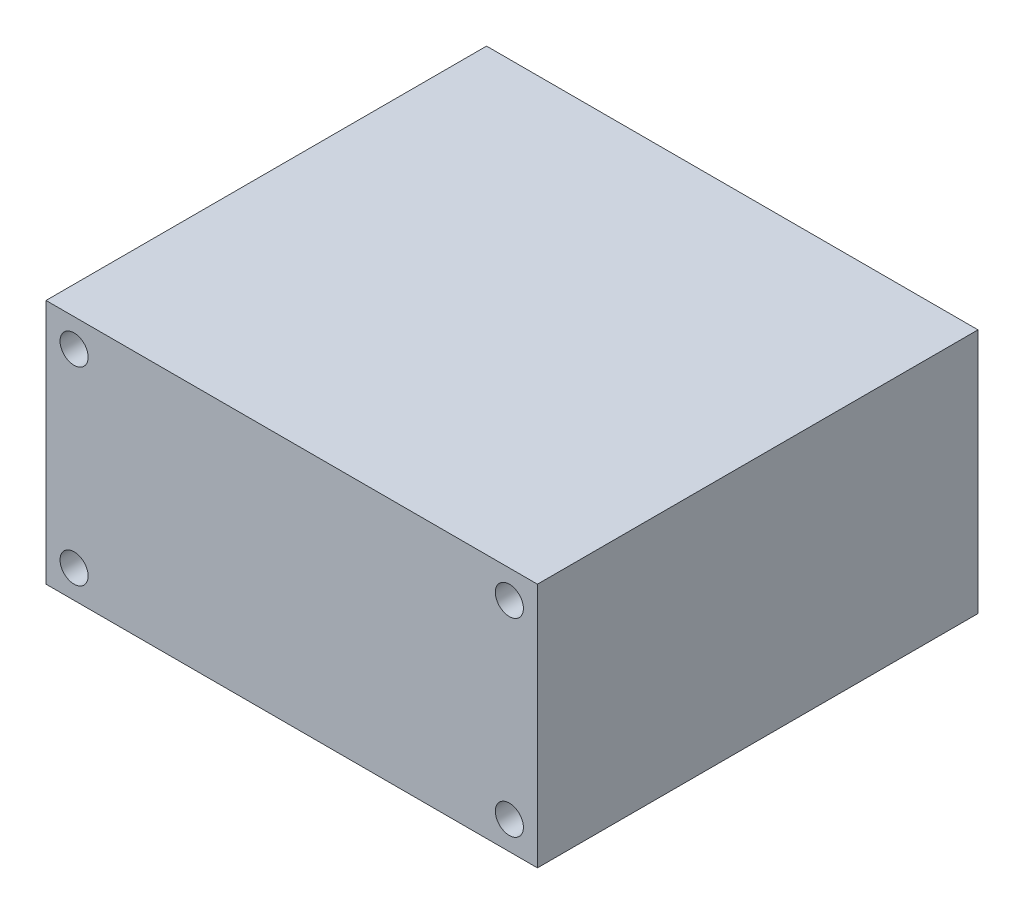
ISO-10303-21;
HEADER;
FILE_DESCRIPTION(('STEP AP214'),'2;1');
FILE_NAME('part.step','',(''),(''),'','','');
FILE_SCHEMA(('AUTOMOTIVE_DESIGN { 1 0 10303 214 1 1 1 1 }'));
ENDSEC;
DATA;
#1=APPLICATION_CONTEXT('core data for automotive mechanical design processes');
#2=APPLICATION_PROTOCOL_DEFINITION('international standard','automotive_design',2000,#1);
#3=PRODUCT_CONTEXT('',#1,'mechanical');
#4=PRODUCT('Part','Part','',(#3));
#5=PRODUCT_RELATED_PRODUCT_CATEGORY('part','',(#4));
#6=PRODUCT_DEFINITION_FORMATION('','',#4);
#7=PRODUCT_DEFINITION_CONTEXT('part definition',#1,'design');
#8=PRODUCT_DEFINITION('design','',#6,#7);
#9=PRODUCT_DEFINITION_SHAPE('','',#8);
#10=(LENGTH_UNIT() NAMED_UNIT(*) SI_UNIT(.MILLI.,.METRE.));
#11=(NAMED_UNIT(*) PLANE_ANGLE_UNIT() SI_UNIT($,.RADIAN.));
#12=(NAMED_UNIT(*) SI_UNIT($,.STERADIAN.) SOLID_ANGLE_UNIT());
#13=UNCERTAINTY_MEASURE_WITH_UNIT(LENGTH_MEASURE(1.E-05),#10,'distance_accuracy_value','');
#14=(GEOMETRIC_REPRESENTATION_CONTEXT(3) GLOBAL_UNCERTAINTY_ASSIGNED_CONTEXT((#13)) GLOBAL_UNIT_ASSIGNED_CONTEXT((#10,
#11,#12)) REPRESENTATION_CONTEXT('',''));
#15=CARTESIAN_POINT('',(0.,0.,0.));
#16=DIRECTION('',(0.,0.,1.));
#17=DIRECTION('',(1.,0.,0.));
#18=AXIS2_PLACEMENT_3D('',#15,#16,#17);
#19=CARTESIAN_POINT('',(0.,28.,50.2));
#20=DIRECTION('',(-1.,0.,0.));
#21=DIRECTION('',(0.,0.,1.));
#22=AXIS2_PLACEMENT_3D('',#19,#20,#21);
#23=PLANE('',#22);
#24=DIRECTION('',(0.,1.,0.));
#25=VECTOR('',#24,1.);
#26=CARTESIAN_POINT('',(0.,28.,0.));
#27=LINE('',#26,#25);
#28=CARTESIAN_POINT('',(0.,0.,0.));
#29=VERTEX_POINT('',#28);
#30=CARTESIAN_POINT('',(0.,28.,0.));
#31=VERTEX_POINT('',#30);
#32=EDGE_CURVE('E98',#29,#31,#27,.T.);
#33=ORIENTED_EDGE('',*,*,#32,.T.);
#34=DIRECTION('',(0.,0.,-1.));
#35=VECTOR('',#34,1.);
#36=CARTESIAN_POINT('',(0.,28.,50.2));
#37=LINE('',#36,#35);
#38=CARTESIAN_POINT('',(0.,28.,50.2));
#39=VERTEX_POINT('',#38);
#40=EDGE_CURVE('E11',#39,#31,#37,.T.);
#41=ORIENTED_EDGE('',*,*,#40,.F.);
#42=DIRECTION('',(0.,1.,0.));
#43=VECTOR('',#42,1.);
#44=CARTESIAN_POINT('',(0.,28.,50.2));
#45=LINE('',#44,#43);
#46=CARTESIAN_POINT('',(0.,0.,50.2));
#47=VERTEX_POINT('',#46);
#48=EDGE_CURVE('E86',#47,#39,#45,.T.);
#49=ORIENTED_EDGE('',*,*,#48,.F.);
#50=DIRECTION('',(0.,0.,-1.));
#51=VECTOR('',#50,1.);
#52=CARTESIAN_POINT('',(0.,0.,50.2));
#53=LINE('',#52,#51);
#54=EDGE_CURVE('E94',#47,#29,#53,.T.);
#55=ORIENTED_EDGE('',*,*,#54,.T.);
#56=EDGE_LOOP('',(#33,#41,#49,#55));
#57=FACE_BOUND('',#56,.T.);
#58=ADVANCED_FACE('F35',(#57),#23,.F.);
#59=CARTESIAN_POINT('',(-56.,28.,50.2));
#60=DIRECTION('',(0.,-1.,0.));
#61=DIRECTION('',(0.,0.,-1.));
#62=AXIS2_PLACEMENT_3D('',#59,#60,#61);
#63=PLANE('',#62);
#64=DIRECTION('',(-1.,0.,0.));
#65=VECTOR('',#64,1.);
#66=CARTESIAN_POINT('',(-56.,28.,0.));
#67=LINE('',#66,#65);
#68=CARTESIAN_POINT('',(-56.,28.,0.));
#69=VERTEX_POINT('',#68);
#70=EDGE_CURVE('E90',#31,#69,#67,.T.);
#71=ORIENTED_EDGE('',*,*,#70,.T.);
#72=DIRECTION('',(0.,0.,-1.));
#73=VECTOR('',#72,1.);
#74=CARTESIAN_POINT('',(-56.,28.,50.2));
#75=LINE('',#74,#73);
#76=CARTESIAN_POINT('',(-56.,28.,50.2));
#77=VERTEX_POINT('',#76);
#78=EDGE_CURVE('E43',#77,#69,#75,.T.);
#79=ORIENTED_EDGE('',*,*,#78,.F.);
#80=DIRECTION('',(-1.,0.,0.));
#81=VECTOR('',#80,1.);
#82=CARTESIAN_POINT('',(-56.,28.,50.2));
#83=LINE('',#82,#81);
#84=EDGE_CURVE('E81',#39,#77,#83,.T.);
#85=ORIENTED_EDGE('',*,*,#84,.F.);
#86=ORIENTED_EDGE('',*,*,#40,.T.);
#87=EDGE_LOOP('',(#71,#79,#85,#86));
#88=FACE_BOUND('',#87,.T.);
#89=ADVANCED_FACE('F89',(#88),#63,.F.);
#90=CARTESIAN_POINT('',(-56.,28.,50.2));
#91=DIRECTION('',(1.,0.,0.));
#92=DIRECTION('',(0.,1.,0.));
#93=AXIS2_PLACEMENT_3D('',#90,#91,#92);
#94=PLANE('',#93);
#95=DIRECTION('',(0.,-1.,0.));
#96=VECTOR('',#95,1.);
#97=CARTESIAN_POINT('',(-56.,28.,0.));
#98=LINE('',#97,#96);
#99=CARTESIAN_POINT('',(-56.,0.,0.));
#100=VERTEX_POINT('',#99);
#101=EDGE_CURVE('E68',#69,#100,#98,.T.);
#102=ORIENTED_EDGE('',*,*,#101,.T.);
#103=DIRECTION('',(0.,0.,-1.));
#104=VECTOR('',#103,1.);
#105=CARTESIAN_POINT('',(-56.,0.,50.2));
#106=LINE('',#105,#104);
#107=CARTESIAN_POINT('',(-56.,0.,50.2));
#108=VERTEX_POINT('',#107);
#109=EDGE_CURVE('E91',#108,#100,#106,.T.);
#110=ORIENTED_EDGE('',*,*,#109,.F.);
#111=DIRECTION('',(0.,-1.,0.));
#112=VECTOR('',#111,1.);
#113=CARTESIAN_POINT('',(-56.,28.,50.2));
#114=LINE('',#113,#112);
#115=EDGE_CURVE('E84',#77,#108,#114,.T.);
#116=ORIENTED_EDGE('',*,*,#115,.F.);
#117=ORIENTED_EDGE('',*,*,#78,.T.);
#118=EDGE_LOOP('',(#102,#110,#116,#117));
#119=FACE_BOUND('',#118,.T.);
#120=ADVANCED_FACE('F92',(#119),#94,.F.);
#121=CARTESIAN_POINT('',(-56.,0.,50.2));
#122=DIRECTION('',(0.,1.,0.));
#123=DIRECTION('',(0.,0.,1.));
#124=AXIS2_PLACEMENT_3D('',#121,#122,#123);
#125=PLANE('',#124);
#126=DIRECTION('',(1.,0.,0.));
#127=VECTOR('',#126,1.);
#128=CARTESIAN_POINT('',(-56.,0.,0.));
#129=LINE('',#128,#127);
#130=EDGE_CURVE('E74',#100,#29,#129,.T.);
#131=ORIENTED_EDGE('',*,*,#130,.T.);
#132=ORIENTED_EDGE('',*,*,#54,.F.);
#133=DIRECTION('',(1.,0.,0.));
#134=VECTOR('',#133,1.);
#135=CARTESIAN_POINT('',(-56.,0.,50.2));
#136=LINE('',#135,#134);
#137=EDGE_CURVE('E51',#108,#47,#136,.T.);
#138=ORIENTED_EDGE('',*,*,#137,.F.);
#139=ORIENTED_EDGE('',*,*,#109,.T.);
#140=EDGE_LOOP('',(#131,#132,#138,#139));
#141=FACE_BOUND('',#140,.T.);
#142=ADVANCED_FACE('F106',(#141),#125,.F.);
#143=CARTESIAN_POINT('',(0.,0.,50.2));
#144=DIRECTION('',(0.,0.,1.));
#145=DIRECTION('',(1.,0.,0.));
#146=AXIS2_PLACEMENT_3D('',#143,#144,#145);
#147=PLANE('',#146);
#148=CARTESIAN_POINT('',(-3.19999999999999,24.8,50.2));
#149=DIRECTION('',(0.,0.,1.));
#150=DIRECTION('',(1.,0.,0.));
#151=AXIS2_PLACEMENT_3D('',#148,#149,#150);
#152=CIRCLE('',#151,1.6);
#153=CARTESIAN_POINT('',(-1.59999999999999,24.8,50.2));
#154=VERTEX_POINT('',#153);
#155=EDGE_CURVE('E121',#154,#154,#152,.T.);
#156=ORIENTED_EDGE('',*,*,#155,.F.);
#157=EDGE_LOOP('',(#156));
#158=FACE_BOUND('',#157,.T.);
#159=CARTESIAN_POINT('',(-3.19999999999999,3.2,50.2));
#160=DIRECTION('',(0.,0.,1.));
#161=DIRECTION('',(1.,0.,0.));
#162=AXIS2_PLACEMENT_3D('',#159,#160,#161);
#163=CIRCLE('',#162,1.6);
#164=CARTESIAN_POINT('',(-1.59999999999999,3.2,50.2));
#165=VERTEX_POINT('',#164);
#166=EDGE_CURVE('E127',#165,#165,#163,.T.);
#167=ORIENTED_EDGE('',*,*,#166,.F.);
#168=EDGE_LOOP('',(#167));
#169=FACE_BOUND('',#168,.T.);
#170=CARTESIAN_POINT('',(-52.8,3.2,50.2));
#171=DIRECTION('',(0.,0.,1.));
#172=DIRECTION('',(1.,0.,0.));
#173=AXIS2_PLACEMENT_3D('',#170,#171,#172);
#174=CIRCLE('',#173,1.6);
#175=CARTESIAN_POINT('',(-51.2,3.2,50.2));
#176=VERTEX_POINT('',#175);
#177=EDGE_CURVE('E115',#176,#176,#174,.T.);
#178=ORIENTED_EDGE('',*,*,#177,.F.);
#179=EDGE_LOOP('',(#178));
#180=FACE_BOUND('',#179,.T.);
#181=CARTESIAN_POINT('',(-52.8,24.8,50.2));
#182=DIRECTION('',(0.,0.,1.));
#183=DIRECTION('',(1.,0.,0.));
#184=AXIS2_PLACEMENT_3D('',#181,#182,#183);
#185=CIRCLE('',#184,1.6);
#186=CARTESIAN_POINT('',(-51.2,24.8,50.2));
#187=VERTEX_POINT('',#186);
#188=EDGE_CURVE('E112',#187,#187,#185,.T.);
#189=ORIENTED_EDGE('',*,*,#188,.F.);
#190=EDGE_LOOP('',(#189));
#191=FACE_BOUND('',#190,.T.);
#192=ORIENTED_EDGE('',*,*,#48,.T.);
#193=ORIENTED_EDGE('',*,*,#84,.T.);
#194=ORIENTED_EDGE('',*,*,#115,.T.);
#195=ORIENTED_EDGE('',*,*,#137,.T.);
#196=EDGE_LOOP('',(#192,#193,#194,#195));
#197=FACE_BOUND('',#196,.T.);
#198=ADVANCED_FACE('F82',(#158,#169,#180,#191,#197),#147,.T.);
#199=CARTESIAN_POINT('',(0.,0.,0.));
#200=DIRECTION('',(0.,0.,1.));
#201=DIRECTION('',(1.,0.,0.));
#202=AXIS2_PLACEMENT_3D('',#199,#200,#201);
#203=PLANE('',#202);
#204=CARTESIAN_POINT('',(-3.19999999999999,24.8,0.));
#205=DIRECTION('',(0.,0.,1.));
#206=DIRECTION('',(1.,0.,0.));
#207=AXIS2_PLACEMENT_3D('',#204,#205,#206);
#208=CIRCLE('',#207,1.6);
#209=CARTESIAN_POINT('',(-1.59999999999999,24.8,0.));
#210=VERTEX_POINT('',#209);
#211=EDGE_CURVE('E118',#210,#210,#208,.T.);
#212=ORIENTED_EDGE('',*,*,#211,.T.);
#213=EDGE_LOOP('',(#212));
#214=FACE_BOUND('',#213,.T.);
#215=CARTESIAN_POINT('',(-3.19999999999999,3.2,0.));
#216=DIRECTION('',(0.,0.,1.));
#217=DIRECTION('',(1.,0.,0.));
#218=AXIS2_PLACEMENT_3D('',#215,#216,#217);
#219=CIRCLE('',#218,1.6);
#220=CARTESIAN_POINT('',(-1.59999999999999,3.2,0.));
#221=VERTEX_POINT('',#220);
#222=EDGE_CURVE('E124',#221,#221,#219,.T.);
#223=ORIENTED_EDGE('',*,*,#222,.T.);
#224=EDGE_LOOP('',(#223));
#225=FACE_BOUND('',#224,.T.);
#226=CARTESIAN_POINT('',(-52.8,3.2,0.));
#227=DIRECTION('',(0.,0.,1.));
#228=DIRECTION('',(1.,0.,0.));
#229=AXIS2_PLACEMENT_3D('',#226,#227,#228);
#230=CIRCLE('',#229,1.6);
#231=CARTESIAN_POINT('',(-51.2,3.2,0.));
#232=VERTEX_POINT('',#231);
#233=EDGE_CURVE('E130',#232,#232,#230,.T.);
#234=ORIENTED_EDGE('',*,*,#233,.T.);
#235=EDGE_LOOP('',(#234));
#236=FACE_BOUND('',#235,.T.);
#237=CARTESIAN_POINT('',(-52.8,24.8,0.));
#238=DIRECTION('',(0.,0.,1.));
#239=DIRECTION('',(1.,0.,0.));
#240=AXIS2_PLACEMENT_3D('',#237,#238,#239);
#241=CIRCLE('',#240,1.6);
#242=CARTESIAN_POINT('',(-51.2,24.8,0.));
#243=VERTEX_POINT('',#242);
#244=EDGE_CURVE('E101',#243,#243,#241,.T.);
#245=ORIENTED_EDGE('',*,*,#244,.T.);
#246=EDGE_LOOP('',(#245));
#247=FACE_BOUND('',#246,.T.);
#248=ORIENTED_EDGE('',*,*,#32,.F.);
#249=ORIENTED_EDGE('',*,*,#130,.F.);
#250=ORIENTED_EDGE('',*,*,#101,.F.);
#251=ORIENTED_EDGE('',*,*,#70,.F.);
#252=EDGE_LOOP('',(#248,#249,#250,#251));
#253=FACE_BOUND('',#252,.T.);
#254=ADVANCED_FACE('F109',(#214,#225,#236,#247,#253),#203,.F.);
#255=CARTESIAN_POINT('',(-52.8,24.8,0.));
#256=DIRECTION('',(0.,0.,1.));
#257=DIRECTION('',(1.,0.,0.));
#258=AXIS2_PLACEMENT_3D('',#255,#256,#257);
#259=CYLINDRICAL_SURFACE('',#258,1.6);
#260=ORIENTED_EDGE('',*,*,#244,.F.);
#261=EDGE_LOOP('',(#260));
#262=FACE_BOUND('',#261,.T.);
#263=ORIENTED_EDGE('',*,*,#188,.T.);
#264=EDGE_LOOP('',(#263));
#265=FACE_BOUND('',#264,.T.);
#266=ADVANCED_FACE('F144',(#262,#265),#259,.F.);
#267=CARTESIAN_POINT('',(-52.8,3.2,0.));
#268=DIRECTION('',(0.,0.,1.));
#269=DIRECTION('',(1.,0.,0.));
#270=AXIS2_PLACEMENT_3D('',#267,#268,#269);
#271=CYLINDRICAL_SURFACE('',#270,1.6);
#272=ORIENTED_EDGE('',*,*,#233,.F.);
#273=EDGE_LOOP('',(#272));
#274=FACE_BOUND('',#273,.T.);
#275=ORIENTED_EDGE('',*,*,#177,.T.);
#276=EDGE_LOOP('',(#275));
#277=FACE_BOUND('',#276,.T.);
#278=ADVANCED_FACE('F136',(#274,#277),#271,.F.);
#279=CARTESIAN_POINT('',(-3.19999999999999,3.2,0.));
#280=DIRECTION('',(0.,0.,1.));
#281=DIRECTION('',(1.,0.,0.));
#282=AXIS2_PLACEMENT_3D('',#279,#280,#281);
#283=CYLINDRICAL_SURFACE('',#282,1.6);
#284=ORIENTED_EDGE('',*,*,#222,.F.);
#285=EDGE_LOOP('',(#284));
#286=FACE_BOUND('',#285,.T.);
#287=ORIENTED_EDGE('',*,*,#166,.T.);
#288=EDGE_LOOP('',(#287));
#289=FACE_BOUND('',#288,.T.);
#290=ADVANCED_FACE('F152',(#286,#289),#283,.F.);
#291=CARTESIAN_POINT('',(-3.19999999999999,24.8,0.));
#292=DIRECTION('',(0.,0.,1.));
#293=DIRECTION('',(1.,0.,0.));
#294=AXIS2_PLACEMENT_3D('',#291,#292,#293);
#295=CYLINDRICAL_SURFACE('',#294,1.6);
#296=ORIENTED_EDGE('',*,*,#211,.F.);
#297=EDGE_LOOP('',(#296));
#298=FACE_BOUND('',#297,.T.);
#299=ORIENTED_EDGE('',*,*,#155,.T.);
#300=EDGE_LOOP('',(#299));
#301=FACE_BOUND('',#300,.T.);
#302=ADVANCED_FACE('F200',(#298,#301),#295,.F.);
#303=CLOSED_SHELL('',(#58,#89,#120,#142,#198,#254,#266,#278,#290,#302));
#304=MANIFOLD_SOLID_BREP('B2',#303);
#305=ADVANCED_BREP_SHAPE_REPRESENTATION('',(#18,#304),#14);
#306=SHAPE_DEFINITION_REPRESENTATION(#9,#305);
ENDSEC;
END-ISO-10303-21;
